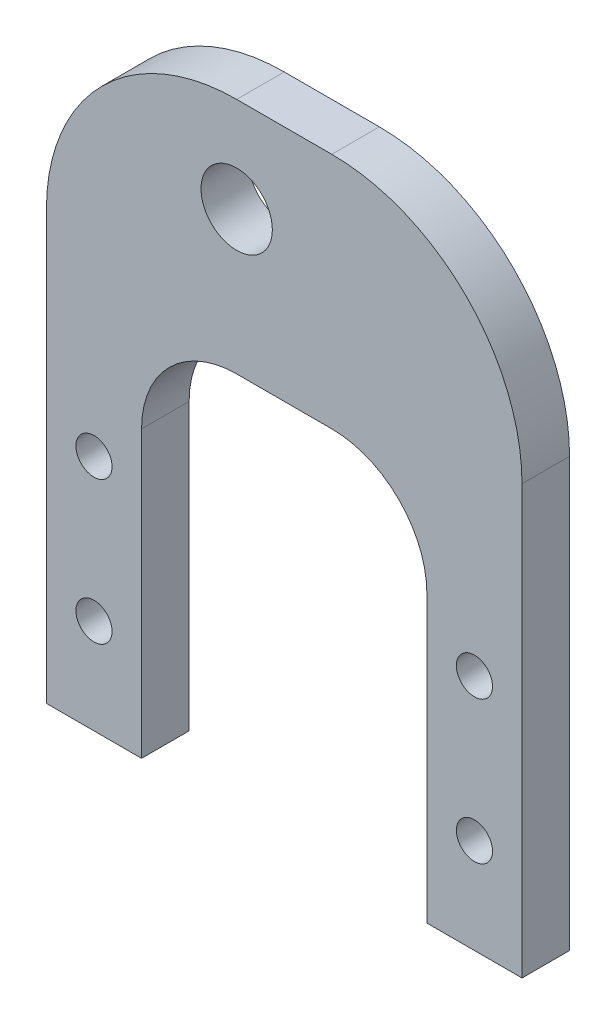
ISO-10303-21;
HEADER;
FILE_DESCRIPTION(('STEP AP214'),'2;1');
FILE_NAME('part.step','',(''),(''),'','','');
FILE_SCHEMA(('AUTOMOTIVE_DESIGN { 1 0 10303 214 1 1 1 1 }'));
ENDSEC;
DATA;
#1=APPLICATION_CONTEXT('core data for automotive mechanical design processes');
#2=APPLICATION_PROTOCOL_DEFINITION('international standard','automotive_design',2000,#1);
#3=PRODUCT_CONTEXT('',#1,'mechanical');
#4=PRODUCT('Part','Part','',(#3));
#5=PRODUCT_RELATED_PRODUCT_CATEGORY('part','',(#4));
#6=PRODUCT_DEFINITION_FORMATION('','',#4);
#7=PRODUCT_DEFINITION_CONTEXT('part definition',#1,'design');
#8=PRODUCT_DEFINITION('design','',#6,#7);
#9=PRODUCT_DEFINITION_SHAPE('','',#8);
#10=(LENGTH_UNIT() NAMED_UNIT(*) SI_UNIT(.MILLI.,.METRE.));
#11=(NAMED_UNIT(*) PLANE_ANGLE_UNIT() SI_UNIT($,.RADIAN.));
#12=(NAMED_UNIT(*) SI_UNIT($,.STERADIAN.) SOLID_ANGLE_UNIT());
#13=UNCERTAINTY_MEASURE_WITH_UNIT(LENGTH_MEASURE(1.E-05),#10,'distance_accuracy_value','');
#14=(GEOMETRIC_REPRESENTATION_CONTEXT(3) GLOBAL_UNCERTAINTY_ASSIGNED_CONTEXT((#13)) GLOBAL_UNIT_ASSIGNED_CONTEXT((#10,
#11,#12)) REPRESENTATION_CONTEXT('',''));
#15=CARTESIAN_POINT('',(0.,0.,0.));
#16=DIRECTION('',(0.,0.,1.));
#17=DIRECTION('',(1.,0.,0.));
#18=AXIS2_PLACEMENT_3D('',#15,#16,#17);
#19=CARTESIAN_POINT('',(0.,0.,6.35));
#20=DIRECTION('',(1.,0.,0.));
#21=DIRECTION('',(0.,0.,-1.));
#22=AXIS2_PLACEMENT_3D('',#19,#20,#21);
#23=PLANE('',#22);
#24=DIRECTION('',(0.,-1.,0.));
#25=VECTOR('',#24,1.);
#26=CARTESIAN_POINT('',(0.,0.,6.35));
#27=LINE('',#26,#25);
#28=CARTESIAN_POINT('',(0.,57.15,6.35));
#29=VERTEX_POINT('',#28);
#30=CARTESIAN_POINT('',(0.,0.,6.35));
#31=VERTEX_POINT('',#30);
#32=EDGE_CURVE('E138',#29,#31,#27,.T.);
#33=ORIENTED_EDGE('',*,*,#32,.F.);
#34=DIRECTION('',(0.,0.,-1.));
#35=VECTOR('',#34,1.);
#36=CARTESIAN_POINT('',(0.,57.15,6.35));
#37=LINE('',#36,#35);
#38=CARTESIAN_POINT('',(0.,57.15,0.));
#39=VERTEX_POINT('',#38);
#40=EDGE_CURVE('E13',#29,#39,#37,.T.);
#41=ORIENTED_EDGE('',*,*,#40,.T.);
#42=DIRECTION('',(0.,-1.,0.));
#43=VECTOR('',#42,1.);
#44=CARTESIAN_POINT('',(0.,0.,0.));
#45=LINE('',#44,#43);
#46=CARTESIAN_POINT('',(0.,0.,0.));
#47=VERTEX_POINT('',#46);
#48=EDGE_CURVE('E159',#39,#47,#45,.T.);
#49=ORIENTED_EDGE('',*,*,#48,.T.);
#50=DIRECTION('',(0.,0.,-1.));
#51=VECTOR('',#50,1.);
#52=CARTESIAN_POINT('',(0.,0.,6.35));
#53=LINE('',#52,#51);
#54=EDGE_CURVE('E152',#31,#47,#53,.T.);
#55=ORIENTED_EDGE('',*,*,#54,.F.);
#56=EDGE_LOOP('',(#33,#41,#49,#55));
#57=FACE_BOUND('',#56,.T.);
#58=ADVANCED_FACE('F49',(#57),#23,.F.);
#59=CARTESIAN_POINT('',(0.,0.,6.35));
#60=DIRECTION('',(0.,1.,0.));
#61=DIRECTION('',(0.,0.,1.));
#62=AXIS2_PLACEMENT_3D('',#59,#60,#61);
#63=PLANE('',#62);
#64=DIRECTION('',(1.,0.,0.));
#65=VECTOR('',#64,1.);
#66=CARTESIAN_POINT('',(0.,0.,0.));
#67=LINE('',#66,#65);
#68=CARTESIAN_POINT('',(12.7,0.,0.));
#69=VERTEX_POINT('',#68);
#70=EDGE_CURVE('E240',#47,#69,#67,.T.);
#71=ORIENTED_EDGE('',*,*,#70,.T.);
#72=DIRECTION('',(0.,0.,-1.));
#73=VECTOR('',#72,1.);
#74=CARTESIAN_POINT('',(12.7,0.,6.35));
#75=LINE('',#74,#73);
#76=CARTESIAN_POINT('',(12.7,0.,6.35));
#77=VERTEX_POINT('',#76);
#78=EDGE_CURVE('E154',#77,#69,#75,.T.);
#79=ORIENTED_EDGE('',*,*,#78,.F.);
#80=DIRECTION('',(1.,0.,0.));
#81=VECTOR('',#80,1.);
#82=CARTESIAN_POINT('',(0.,0.,6.35));
#83=LINE('',#82,#81);
#84=EDGE_CURVE('E142',#31,#77,#83,.T.);
#85=ORIENTED_EDGE('',*,*,#84,.F.);
#86=ORIENTED_EDGE('',*,*,#54,.T.);
#87=EDGE_LOOP('',(#71,#79,#85,#86));
#88=FACE_BOUND('',#87,.T.);
#89=ADVANCED_FACE('F151',(#88),#63,.F.);
#90=CARTESIAN_POINT('',(12.7,0.,6.35));
#91=DIRECTION('',(-1.,0.,0.));
#92=DIRECTION('',(0.,0.,1.));
#93=AXIS2_PLACEMENT_3D('',#90,#91,#92);
#94=PLANE('',#93);
#95=DIRECTION('',(0.,1.,0.));
#96=VECTOR('',#95,1.);
#97=CARTESIAN_POINT('',(12.7,0.,0.));
#98=LINE('',#97,#96);
#99=CARTESIAN_POINT('',(12.7,38.1,0.));
#100=VERTEX_POINT('',#99);
#101=EDGE_CURVE('E235',#69,#100,#98,.T.);
#102=ORIENTED_EDGE('',*,*,#101,.T.);
#103=DIRECTION('',(0.,0.,-1.));
#104=VECTOR('',#103,1.);
#105=CARTESIAN_POINT('',(12.7,38.1,6.35));
#106=LINE('',#105,#104);
#107=CARTESIAN_POINT('',(12.7,38.1,6.35));
#108=VERTEX_POINT('',#107);
#109=EDGE_CURVE('E171',#100,#108,#106,.F.);
#110=ORIENTED_EDGE('',*,*,#109,.T.);
#111=DIRECTION('',(0.,1.,0.));
#112=VECTOR('',#111,1.);
#113=CARTESIAN_POINT('',(12.7,0.,6.35));
#114=LINE('',#113,#112);
#115=EDGE_CURVE('E156',#77,#108,#114,.T.);
#116=ORIENTED_EDGE('',*,*,#115,.F.);
#117=ORIENTED_EDGE('',*,*,#78,.T.);
#118=EDGE_LOOP('',(#102,#110,#116,#117));
#119=FACE_BOUND('',#118,.T.);
#120=ADVANCED_FACE('F316',(#119),#94,.F.);
#121=CARTESIAN_POINT('',(12.7,50.8,6.35));
#122=DIRECTION('',(0.,1.,0.));
#123=DIRECTION('',(0.,0.,1.));
#124=AXIS2_PLACEMENT_3D('',#121,#122,#123);
#125=PLANE('',#124);
#126=DIRECTION('',(1.,0.,0.));
#127=VECTOR('',#126,1.);
#128=CARTESIAN_POINT('',(12.7,50.8,6.35));
#129=LINE('',#128,#127);
#130=CARTESIAN_POINT('',(25.4,50.8,6.35));
#131=VERTEX_POINT('',#130);
#132=CARTESIAN_POINT('',(38.1,50.8,6.35));
#133=VERTEX_POINT('',#132);
#134=EDGE_CURVE('E248',#131,#133,#129,.T.);
#135=ORIENTED_EDGE('',*,*,#134,.F.);
#136=DIRECTION('',(0.,0.,-1.));
#137=VECTOR('',#136,1.);
#138=CARTESIAN_POINT('',(25.4,50.8,0.));
#139=LINE('',#138,#137);
#140=CARTESIAN_POINT('',(25.4,50.8,0.));
#141=VERTEX_POINT('',#140);
#142=EDGE_CURVE('E163',#131,#141,#139,.T.);
#143=ORIENTED_EDGE('',*,*,#142,.T.);
#144=DIRECTION('',(1.,0.,0.));
#145=VECTOR('',#144,1.);
#146=CARTESIAN_POINT('',(12.7,50.8,0.));
#147=LINE('',#146,#145);
#148=CARTESIAN_POINT('',(38.1,50.8,0.));
#149=VERTEX_POINT('',#148);
#150=EDGE_CURVE('E234',#141,#149,#147,.T.);
#151=ORIENTED_EDGE('',*,*,#150,.T.);
#152=DIRECTION('',(0.,0.,-1.));
#153=VECTOR('',#152,1.);
#154=CARTESIAN_POINT('',(38.1,50.8,6.35));
#155=LINE('',#154,#153);
#156=EDGE_CURVE('E161',#149,#133,#155,.F.);
#157=ORIENTED_EDGE('',*,*,#156,.T.);
#158=EDGE_LOOP('',(#135,#143,#151,#157));
#159=FACE_BOUND('',#158,.T.);
#160=ADVANCED_FACE('F341',(#159),#125,.F.);
#161=CARTESIAN_POINT('',(50.8,50.8,6.35));
#162=DIRECTION('',(1.,0.,0.));
#163=DIRECTION('',(0.,0.,-1.));
#164=AXIS2_PLACEMENT_3D('',#161,#162,#163);
#165=PLANE('',#164);
#166=DIRECTION('',(0.,-1.,0.));
#167=VECTOR('',#166,1.);
#168=CARTESIAN_POINT('',(50.8,50.8,6.35));
#169=LINE('',#168,#167);
#170=CARTESIAN_POINT('',(50.8,38.1,6.35));
#171=VERTEX_POINT('',#170);
#172=CARTESIAN_POINT('',(50.8,0.,6.35));
#173=VERTEX_POINT('',#172);
#174=EDGE_CURVE('E246',#171,#173,#169,.T.);
#175=ORIENTED_EDGE('',*,*,#174,.F.);
#176=DIRECTION('',(0.,0.,-1.));
#177=VECTOR('',#176,1.);
#178=CARTESIAN_POINT('',(50.8,38.1,0.));
#179=LINE('',#178,#177);
#180=CARTESIAN_POINT('',(50.8,38.1,0.));
#181=VERTEX_POINT('',#180);
#182=EDGE_CURVE('E173',#171,#181,#179,.T.);
#183=ORIENTED_EDGE('',*,*,#182,.T.);
#184=DIRECTION('',(0.,-1.,0.));
#185=VECTOR('',#184,1.);
#186=CARTESIAN_POINT('',(50.8,50.8,0.));
#187=LINE('',#186,#185);
#188=CARTESIAN_POINT('',(50.8,0.,0.));
#189=VERTEX_POINT('',#188);
#190=EDGE_CURVE('E219',#181,#189,#187,.T.);
#191=ORIENTED_EDGE('',*,*,#190,.T.);
#192=DIRECTION('',(0.,0.,-1.));
#193=VECTOR('',#192,1.);
#194=CARTESIAN_POINT('',(50.8,0.,6.35));
#195=LINE('',#194,#193);
#196=EDGE_CURVE('E165',#173,#189,#195,.T.);
#197=ORIENTED_EDGE('',*,*,#196,.F.);
#198=EDGE_LOOP('',(#175,#183,#191,#197));
#199=FACE_BOUND('',#198,.T.);
#200=ADVANCED_FACE('F345',(#199),#165,.F.);
#201=CARTESIAN_POINT('',(50.8,0.,6.35));
#202=DIRECTION('',(0.,1.,0.));
#203=DIRECTION('',(0.,0.,1.));
#204=AXIS2_PLACEMENT_3D('',#201,#202,#203);
#205=PLANE('',#204);
#206=DIRECTION('',(1.,0.,0.));
#207=VECTOR('',#206,1.);
#208=CARTESIAN_POINT('',(50.8,0.,0.));
#209=LINE('',#208,#207);
#210=CARTESIAN_POINT('',(63.5,0.,0.));
#211=VERTEX_POINT('',#210);
#212=EDGE_CURVE('E216',#189,#211,#209,.T.);
#213=ORIENTED_EDGE('',*,*,#212,.T.);
#214=DIRECTION('',(0.,0.,-1.));
#215=VECTOR('',#214,1.);
#216=CARTESIAN_POINT('',(63.5,0.,6.35));
#217=LINE('',#216,#215);
#218=CARTESIAN_POINT('',(63.5,0.,6.35));
#219=VERTEX_POINT('',#218);
#220=EDGE_CURVE('E205',#219,#211,#217,.T.);
#221=ORIENTED_EDGE('',*,*,#220,.F.);
#222=DIRECTION('',(1.,0.,0.));
#223=VECTOR('',#222,1.);
#224=CARTESIAN_POINT('',(50.8,0.,6.35));
#225=LINE('',#224,#223);
#226=EDGE_CURVE('E228',#173,#219,#225,.T.);
#227=ORIENTED_EDGE('',*,*,#226,.F.);
#228=ORIENTED_EDGE('',*,*,#196,.T.);
#229=EDGE_LOOP('',(#213,#221,#227,#228));
#230=FACE_BOUND('',#229,.T.);
#231=ADVANCED_FACE('F227',(#230),#205,.F.);
#232=CARTESIAN_POINT('',(63.5,0.,6.35));
#233=DIRECTION('',(-1.,0.,0.));
#234=DIRECTION('',(0.,0.,1.));
#235=AXIS2_PLACEMENT_3D('',#232,#233,#234);
#236=PLANE('',#235);
#237=DIRECTION('',(0.,1.,0.));
#238=VECTOR('',#237,1.);
#239=CARTESIAN_POINT('',(63.5,0.,0.));
#240=LINE('',#239,#238);
#241=CARTESIAN_POINT('',(63.5,57.15,0.));
#242=VERTEX_POINT('',#241);
#243=EDGE_CURVE('E212',#211,#242,#240,.T.);
#244=ORIENTED_EDGE('',*,*,#243,.T.);
#245=DIRECTION('',(0.,0.,-1.));
#246=VECTOR('',#245,1.);
#247=CARTESIAN_POINT('',(63.5,57.15,6.35));
#248=LINE('',#247,#246);
#249=CARTESIAN_POINT('',(63.5,57.15,6.35));
#250=VERTEX_POINT('',#249);
#251=EDGE_CURVE('E72',#242,#250,#248,.F.);
#252=ORIENTED_EDGE('',*,*,#251,.T.);
#253=DIRECTION('',(0.,1.,0.));
#254=VECTOR('',#253,1.);
#255=CARTESIAN_POINT('',(63.5,0.,6.35));
#256=LINE('',#255,#254);
#257=EDGE_CURVE('E197',#219,#250,#256,.T.);
#258=ORIENTED_EDGE('',*,*,#257,.F.);
#259=ORIENTED_EDGE('',*,*,#220,.T.);
#260=EDGE_LOOP('',(#244,#252,#258,#259));
#261=FACE_BOUND('',#260,.T.);
#262=ADVANCED_FACE('F214',(#261),#236,.F.);
#263=CARTESIAN_POINT('',(0.,82.55,6.35));
#264=DIRECTION('',(0.,-1.,0.));
#265=DIRECTION('',(0.,0.,-1.));
#266=AXIS2_PLACEMENT_3D('',#263,#264,#265);
#267=PLANE('',#266);
#268=DIRECTION('',(-1.,0.,0.));
#269=VECTOR('',#268,1.);
#270=CARTESIAN_POINT('',(0.,82.55,6.35));
#271=LINE('',#270,#269);
#272=CARTESIAN_POINT('',(38.1,82.55,6.35));
#273=VERTEX_POINT('',#272);
#274=CARTESIAN_POINT('',(25.4,82.55,6.35));
#275=VERTEX_POINT('',#274);
#276=EDGE_CURVE('E196',#273,#275,#271,.T.);
#277=ORIENTED_EDGE('',*,*,#276,.F.);
#278=DIRECTION('',(0.,0.,-1.));
#279=VECTOR('',#278,1.);
#280=CARTESIAN_POINT('',(38.1,82.55,6.35));
#281=LINE('',#280,#279);
#282=CARTESIAN_POINT('',(38.1,82.55,0.));
#283=VERTEX_POINT('',#282);
#284=EDGE_CURVE('E186',#273,#283,#281,.T.);
#285=ORIENTED_EDGE('',*,*,#284,.T.);
#286=DIRECTION('',(-1.,0.,0.));
#287=VECTOR('',#286,1.);
#288=CARTESIAN_POINT('',(0.,82.55,0.));
#289=LINE('',#288,#287);
#290=CARTESIAN_POINT('',(25.4,82.55,0.));
#291=VERTEX_POINT('',#290);
#292=EDGE_CURVE('E147',#283,#291,#289,.T.);
#293=ORIENTED_EDGE('',*,*,#292,.T.);
#294=DIRECTION('',(0.,0.,-1.));
#295=VECTOR('',#294,1.);
#296=CARTESIAN_POINT('',(25.4,82.55,6.35));
#297=LINE('',#296,#295);
#298=EDGE_CURVE('E184',#291,#275,#297,.F.);
#299=ORIENTED_EDGE('',*,*,#298,.T.);
#300=EDGE_LOOP('',(#277,#285,#293,#299));
#301=FACE_BOUND('',#300,.T.);
#302=ADVANCED_FACE('F201',(#301),#267,.F.);
#303=CARTESIAN_POINT('',(0.,0.,6.35));
#304=DIRECTION('',(0.,0.,-1.));
#305=DIRECTION('',(-1.,0.,0.));
#306=AXIS2_PLACEMENT_3D('',#303,#304,#305);
#307=PLANE('',#306);
#308=CARTESIAN_POINT('',(25.4,69.85,6.35));
#309=DIRECTION('',(0.,0.,1.));
#310=DIRECTION('',(1.,0.,0.));
#311=AXIS2_PLACEMENT_3D('',#308,#309,#310);
#312=CIRCLE('',#311,4.7625);
#313=CARTESIAN_POINT('',(30.1625,69.85,6.35));
#314=VERTEX_POINT('',#313);
#315=EDGE_CURVE('E273',#314,#314,#312,.T.);
#316=ORIENTED_EDGE('',*,*,#315,.F.);
#317=EDGE_LOOP('',(#316));
#318=FACE_BOUND('',#317,.T.);
#319=CARTESIAN_POINT('',(6.35,31.75,6.35));
#320=DIRECTION('',(0.,0.,1.));
#321=DIRECTION('',(1.,0.,0.));
#322=AXIS2_PLACEMENT_3D('',#319,#320,#321);
#323=CIRCLE('',#322,2.413);
#324=CARTESIAN_POINT('',(8.76299999999999,31.75,6.35));
#325=VERTEX_POINT('',#324);
#326=EDGE_CURVE('E255',#325,#325,#323,.T.);
#327=ORIENTED_EDGE('',*,*,#326,.F.);
#328=EDGE_LOOP('',(#327));
#329=FACE_BOUND('',#328,.T.);
#330=CARTESIAN_POINT('',(57.15,12.7,6.35));
#331=DIRECTION('',(0.,0.,1.));
#332=DIRECTION('',(1.,0.,0.));
#333=AXIS2_PLACEMENT_3D('',#330,#331,#332);
#334=CIRCLE('',#333,2.41299999999999);
#335=CARTESIAN_POINT('',(59.563,12.7,6.35));
#336=VERTEX_POINT('',#335);
#337=EDGE_CURVE('E261',#336,#336,#334,.T.);
#338=ORIENTED_EDGE('',*,*,#337,.F.);
#339=EDGE_LOOP('',(#338));
#340=FACE_BOUND('',#339,.T.);
#341=CARTESIAN_POINT('',(57.15,31.75,6.35));
#342=DIRECTION('',(0.,0.,1.));
#343=DIRECTION('',(1.,0.,0.));
#344=AXIS2_PLACEMENT_3D('',#341,#342,#343);
#345=CIRCLE('',#344,2.41299999999999);
#346=CARTESIAN_POINT('',(59.563,31.75,6.35));
#347=VERTEX_POINT('',#346);
#348=EDGE_CURVE('E262',#347,#347,#345,.T.);
#349=ORIENTED_EDGE('',*,*,#348,.F.);
#350=EDGE_LOOP('',(#349));
#351=FACE_BOUND('',#350,.T.);
#352=CARTESIAN_POINT('',(6.35,12.7,6.35));
#353=DIRECTION('',(0.,0.,1.));
#354=DIRECTION('',(1.,0.,0.));
#355=AXIS2_PLACEMENT_3D('',#352,#353,#354);
#356=CIRCLE('',#355,2.413);
#357=CARTESIAN_POINT('',(8.76299999999999,12.7,6.35));
#358=VERTEX_POINT('',#357);
#359=EDGE_CURVE('E242',#358,#358,#356,.T.);
#360=ORIENTED_EDGE('',*,*,#359,.F.);
#361=EDGE_LOOP('',(#360));
#362=FACE_BOUND('',#361,.T.);
#363=ORIENTED_EDGE('',*,*,#257,.T.);
#364=CARTESIAN_POINT('',(38.1,57.15,6.35));
#365=DIRECTION('',(0.,0.,-1.));
#366=DIRECTION('',(-1.,0.,0.));
#367=AXIS2_PLACEMENT_3D('',#364,#365,#366);
#368=CIRCLE('',#367,25.4);
#369=EDGE_CURVE('E57',#250,#273,#368,.F.);
#370=ORIENTED_EDGE('',*,*,#369,.T.);
#371=ORIENTED_EDGE('',*,*,#276,.T.);
#372=CARTESIAN_POINT('',(25.4,57.15,6.35));
#373=DIRECTION('',(0.,0.,-1.));
#374=DIRECTION('',(-1.,0.,0.));
#375=AXIS2_PLACEMENT_3D('',#372,#373,#374);
#376=CIRCLE('',#375,25.4);
#377=EDGE_CURVE('E64',#275,#29,#376,.F.);
#378=ORIENTED_EDGE('',*,*,#377,.T.);
#379=ORIENTED_EDGE('',*,*,#32,.T.);
#380=ORIENTED_EDGE('',*,*,#84,.T.);
#381=ORIENTED_EDGE('',*,*,#115,.T.);
#382=CARTESIAN_POINT('',(25.4,38.1,6.35));
#383=DIRECTION('',(0.,0.,-1.));
#384=DIRECTION('',(-1.,0.,0.));
#385=AXIS2_PLACEMENT_3D('',#382,#383,#384);
#386=CIRCLE('',#385,12.7);
#387=EDGE_CURVE('E178',#108,#131,#386,.T.);
#388=ORIENTED_EDGE('',*,*,#387,.T.);
#389=ORIENTED_EDGE('',*,*,#134,.T.);
#390=CARTESIAN_POINT('',(38.1,38.1,6.35));
#391=DIRECTION('',(0.,0.,-1.));
#392=DIRECTION('',(-1.,0.,0.));
#393=AXIS2_PLACEMENT_3D('',#390,#391,#392);
#394=CIRCLE('',#393,12.7);
#395=EDGE_CURVE('E182',#133,#171,#394,.T.);
#396=ORIENTED_EDGE('',*,*,#395,.T.);
#397=ORIENTED_EDGE('',*,*,#174,.T.);
#398=ORIENTED_EDGE('',*,*,#226,.T.);
#399=EDGE_LOOP('',(#363,#370,#371,#378,#379,#380,#381,#388,#389,#396,#397,#398));
#400=FACE_BOUND('',#399,.T.);
#401=ADVANCED_FACE('F140',(#318,#329,#340,#351,#362,#400),#307,.F.);
#402=CARTESIAN_POINT('',(0.,0.,0.));
#403=DIRECTION('',(0.,0.,-1.));
#404=DIRECTION('',(-1.,0.,0.));
#405=AXIS2_PLACEMENT_3D('',#402,#403,#404);
#406=PLANE('',#405);
#407=CARTESIAN_POINT('',(25.4,69.85,0.));
#408=DIRECTION('',(0.,0.,-1.));
#409=DIRECTION('',(-1.,0.,0.));
#410=AXIS2_PLACEMENT_3D('',#407,#408,#409);
#411=CIRCLE('',#410,4.7625);
#412=CARTESIAN_POINT('',(20.6375,69.85,0.));
#413=VERTEX_POINT('',#412);
#414=EDGE_CURVE('E276',#413,#413,#411,.F.);
#415=ORIENTED_EDGE('',*,*,#414,.T.);
#416=EDGE_LOOP('',(#415));
#417=FACE_BOUND('',#416,.T.);
#418=CARTESIAN_POINT('',(6.35,31.75,0.));
#419=DIRECTION('',(0.,0.,-1.));
#420=DIRECTION('',(-1.,0.,0.));
#421=AXIS2_PLACEMENT_3D('',#418,#419,#420);
#422=CIRCLE('',#421,2.413);
#423=CARTESIAN_POINT('',(3.937,31.75,0.));
#424=VERTEX_POINT('',#423);
#425=EDGE_CURVE('E265',#424,#424,#422,.F.);
#426=ORIENTED_EDGE('',*,*,#425,.T.);
#427=EDGE_LOOP('',(#426));
#428=FACE_BOUND('',#427,.T.);
#429=CARTESIAN_POINT('',(57.15,12.7,0.));
#430=DIRECTION('',(0.,0.,-1.));
#431=DIRECTION('',(-1.,0.,0.));
#432=AXIS2_PLACEMENT_3D('',#429,#430,#431);
#433=CIRCLE('',#432,2.41299999999999);
#434=CARTESIAN_POINT('',(54.737,12.7,0.));
#435=VERTEX_POINT('',#434);
#436=EDGE_CURVE('E258',#435,#435,#433,.F.);
#437=ORIENTED_EDGE('',*,*,#436,.T.);
#438=EDGE_LOOP('',(#437));
#439=FACE_BOUND('',#438,.T.);
#440=CARTESIAN_POINT('',(57.15,31.75,0.));
#441=DIRECTION('',(0.,0.,-1.));
#442=DIRECTION('',(-1.,0.,0.));
#443=AXIS2_PLACEMENT_3D('',#440,#441,#442);
#444=CIRCLE('',#443,2.41299999999999);
#445=CARTESIAN_POINT('',(54.737,31.75,0.));
#446=VERTEX_POINT('',#445);
#447=EDGE_CURVE('E270',#446,#446,#444,.F.);
#448=ORIENTED_EDGE('',*,*,#447,.T.);
#449=EDGE_LOOP('',(#448));
#450=FACE_BOUND('',#449,.T.);
#451=CARTESIAN_POINT('',(6.35,12.7,0.));
#452=DIRECTION('',(0.,0.,-1.));
#453=DIRECTION('',(-1.,0.,0.));
#454=AXIS2_PLACEMENT_3D('',#451,#452,#453);
#455=CIRCLE('',#454,2.413);
#456=CARTESIAN_POINT('',(3.937,12.7,0.));
#457=VERTEX_POINT('',#456);
#458=EDGE_CURVE('E252',#457,#457,#455,.F.);
#459=ORIENTED_EDGE('',*,*,#458,.T.);
#460=EDGE_LOOP('',(#459));
#461=FACE_BOUND('',#460,.T.);
#462=ORIENTED_EDGE('',*,*,#292,.F.);
#463=CARTESIAN_POINT('',(38.1,57.15,0.));
#464=DIRECTION('',(0.,0.,-1.));
#465=DIRECTION('',(-1.,0.,0.));
#466=AXIS2_PLACEMENT_3D('',#463,#464,#465);
#467=CIRCLE('',#466,25.4);
#468=EDGE_CURVE('E191',#283,#242,#467,.T.);
#469=ORIENTED_EDGE('',*,*,#468,.T.);
#470=ORIENTED_EDGE('',*,*,#243,.F.);
#471=ORIENTED_EDGE('',*,*,#212,.F.);
#472=ORIENTED_EDGE('',*,*,#190,.F.);
#473=CARTESIAN_POINT('',(38.1,38.1,0.));
#474=DIRECTION('',(0.,0.,-1.));
#475=DIRECTION('',(-1.,0.,0.));
#476=AXIS2_PLACEMENT_3D('',#473,#474,#475);
#477=CIRCLE('',#476,12.7);
#478=EDGE_CURVE('E180',#181,#149,#477,.F.);
#479=ORIENTED_EDGE('',*,*,#478,.T.);
#480=ORIENTED_EDGE('',*,*,#150,.F.);
#481=CARTESIAN_POINT('',(25.4,38.1,0.));
#482=DIRECTION('',(0.,0.,-1.));
#483=DIRECTION('',(-1.,0.,0.));
#484=AXIS2_PLACEMENT_3D('',#481,#482,#483);
#485=CIRCLE('',#484,12.7);
#486=EDGE_CURVE('E176',#141,#100,#485,.F.);
#487=ORIENTED_EDGE('',*,*,#486,.T.);
#488=ORIENTED_EDGE('',*,*,#101,.F.);
#489=ORIENTED_EDGE('',*,*,#70,.F.);
#490=ORIENTED_EDGE('',*,*,#48,.F.);
#491=CARTESIAN_POINT('',(25.4,57.15,0.));
#492=DIRECTION('',(0.,0.,-1.));
#493=DIRECTION('',(-1.,0.,0.));
#494=AXIS2_PLACEMENT_3D('',#491,#492,#493);
#495=CIRCLE('',#494,25.4);
#496=EDGE_CURVE('E189',#39,#291,#495,.T.);
#497=ORIENTED_EDGE('',*,*,#496,.T.);
#498=EDGE_LOOP('',(#462,#469,#470,#471,#472,#479,#480,#487,#488,#489,#490,#497));
#499=FACE_BOUND('',#498,.T.);
#500=ADVANCED_FACE('F210',(#417,#428,#439,#450,#461,#499),#406,.T.);
#501=CARTESIAN_POINT('',(6.35,12.7,-0.00100000000000013));
#502=DIRECTION('',(0.,0.,1.));
#503=DIRECTION('',(1.,0.,0.));
#504=AXIS2_PLACEMENT_3D('',#501,#502,#503);
#505=CYLINDRICAL_SURFACE('',#504,2.413);
#506=ORIENTED_EDGE('',*,*,#458,.F.);
#507=EDGE_LOOP('',(#506));
#508=FACE_BOUND('',#507,.T.);
#509=ORIENTED_EDGE('',*,*,#359,.T.);
#510=EDGE_LOOP('',(#509));
#511=FACE_BOUND('',#510,.T.);
#512=ADVANCED_FACE('F295',(#508,#511),#505,.F.);
#513=CARTESIAN_POINT('',(57.15,31.75,-0.00100000000000013));
#514=DIRECTION('',(0.,0.,1.));
#515=DIRECTION('',(1.,0.,0.));
#516=AXIS2_PLACEMENT_3D('',#513,#514,#515);
#517=CYLINDRICAL_SURFACE('',#516,2.41299999999999);
#518=ORIENTED_EDGE('',*,*,#447,.F.);
#519=EDGE_LOOP('',(#518));
#520=FACE_BOUND('',#519,.T.);
#521=ORIENTED_EDGE('',*,*,#348,.T.);
#522=EDGE_LOOP('',(#521));
#523=FACE_BOUND('',#522,.T.);
#524=ADVANCED_FACE('F297',(#520,#523),#517,.F.);
#525=CARTESIAN_POINT('',(57.15,12.7,-0.00100000000000013));
#526=DIRECTION('',(0.,0.,1.));
#527=DIRECTION('',(1.,0.,0.));
#528=AXIS2_PLACEMENT_3D('',#525,#526,#527);
#529=CYLINDRICAL_SURFACE('',#528,2.41299999999999);
#530=ORIENTED_EDGE('',*,*,#436,.F.);
#531=EDGE_LOOP('',(#530));
#532=FACE_BOUND('',#531,.T.);
#533=ORIENTED_EDGE('',*,*,#337,.T.);
#534=EDGE_LOOP('',(#533));
#535=FACE_BOUND('',#534,.T.);
#536=ADVANCED_FACE('F304',(#532,#535),#529,.F.);
#537=CARTESIAN_POINT('',(6.35,31.75,-0.00100000000000013));
#538=DIRECTION('',(0.,0.,1.));
#539=DIRECTION('',(1.,0.,0.));
#540=AXIS2_PLACEMENT_3D('',#537,#538,#539);
#541=CYLINDRICAL_SURFACE('',#540,2.413);
#542=ORIENTED_EDGE('',*,*,#425,.F.);
#543=EDGE_LOOP('',(#542));
#544=FACE_BOUND('',#543,.T.);
#545=ORIENTED_EDGE('',*,*,#326,.T.);
#546=EDGE_LOOP('',(#545));
#547=FACE_BOUND('',#546,.T.);
#548=ADVANCED_FACE('F444',(#544,#547),#541,.F.);
#549=CARTESIAN_POINT('',(25.4,69.85,-0.00100000000000013));
#550=DIRECTION('',(0.,0.,1.));
#551=DIRECTION('',(1.,0.,0.));
#552=AXIS2_PLACEMENT_3D('',#549,#550,#551);
#553=CYLINDRICAL_SURFACE('',#552,4.7625);
#554=ORIENTED_EDGE('',*,*,#414,.F.);
#555=EDGE_LOOP('',(#554));
#556=FACE_BOUND('',#555,.T.);
#557=ORIENTED_EDGE('',*,*,#315,.T.);
#558=EDGE_LOOP('',(#557));
#559=FACE_BOUND('',#558,.T.);
#560=ADVANCED_FACE('F282',(#556,#559),#553,.F.);
#561=CARTESIAN_POINT('',(25.4,38.1,6.35));
#562=DIRECTION('',(0.,0.,1.));
#563=DIRECTION('',(1.,0.,0.));
#564=AXIS2_PLACEMENT_3D('',#561,#562,#563);
#565=CYLINDRICAL_SURFACE('',#564,12.7);
#566=ORIENTED_EDGE('',*,*,#387,.F.);
#567=ORIENTED_EDGE('',*,*,#109,.F.);
#568=ORIENTED_EDGE('',*,*,#486,.F.);
#569=ORIENTED_EDGE('',*,*,#142,.F.);
#570=EDGE_LOOP('',(#566,#567,#568,#569));
#571=FACE_BOUND('',#570,.T.);
#572=ADVANCED_FACE('F320',(#571),#565,.F.);
#573=CARTESIAN_POINT('',(38.1,38.1,6.35));
#574=DIRECTION('',(0.,0.,1.));
#575=DIRECTION('',(1.,0.,0.));
#576=AXIS2_PLACEMENT_3D('',#573,#574,#575);
#577=CYLINDRICAL_SURFACE('',#576,12.7);
#578=ORIENTED_EDGE('',*,*,#395,.F.);
#579=ORIENTED_EDGE('',*,*,#156,.F.);
#580=ORIENTED_EDGE('',*,*,#478,.F.);
#581=ORIENTED_EDGE('',*,*,#182,.F.);
#582=EDGE_LOOP('',(#578,#579,#580,#581));
#583=FACE_BOUND('',#582,.T.);
#584=ADVANCED_FACE('F323',(#583),#577,.F.);
#585=CARTESIAN_POINT('',(38.1,57.15,6.35));
#586=DIRECTION('',(0.,0.,-1.));
#587=DIRECTION('',(-1.,0.,0.));
#588=AXIS2_PLACEMENT_3D('',#585,#586,#587);
#589=CYLINDRICAL_SURFACE('',#588,25.4);
#590=ORIENTED_EDGE('',*,*,#369,.F.);
#591=ORIENTED_EDGE('',*,*,#251,.F.);
#592=ORIENTED_EDGE('',*,*,#468,.F.);
#593=ORIENTED_EDGE('',*,*,#284,.F.);
#594=EDGE_LOOP('',(#590,#591,#592,#593));
#595=FACE_BOUND('',#594,.T.);
#596=ADVANCED_FACE('F207',(#595),#589,.T.);
#597=CARTESIAN_POINT('',(25.4,57.15,6.35));
#598=DIRECTION('',(0.,0.,-1.));
#599=DIRECTION('',(-1.,0.,0.));
#600=AXIS2_PLACEMENT_3D('',#597,#598,#599);
#601=CYLINDRICAL_SURFACE('',#600,25.4);
#602=ORIENTED_EDGE('',*,*,#377,.F.);
#603=ORIENTED_EDGE('',*,*,#298,.F.);
#604=ORIENTED_EDGE('',*,*,#496,.F.);
#605=ORIENTED_EDGE('',*,*,#40,.F.);
#606=EDGE_LOOP('',(#602,#603,#604,#605));
#607=FACE_BOUND('',#606,.T.);
#608=ADVANCED_FACE('F51',(#607),#601,.T.);
#609=CLOSED_SHELL('',(#58,#89,#120,#160,#200,#231,#262,#302,#401,#500,#512,#524,#536,#548,#560,
#572,#584,#596,#608));
#610=MANIFOLD_SOLID_BREP('B2',#609);
#611=ADVANCED_BREP_SHAPE_REPRESENTATION('',(#18,#610),#14);
#612=SHAPE_DEFINITION_REPRESENTATION(#9,#611);
ENDSEC;
END-ISO-10303-21;
